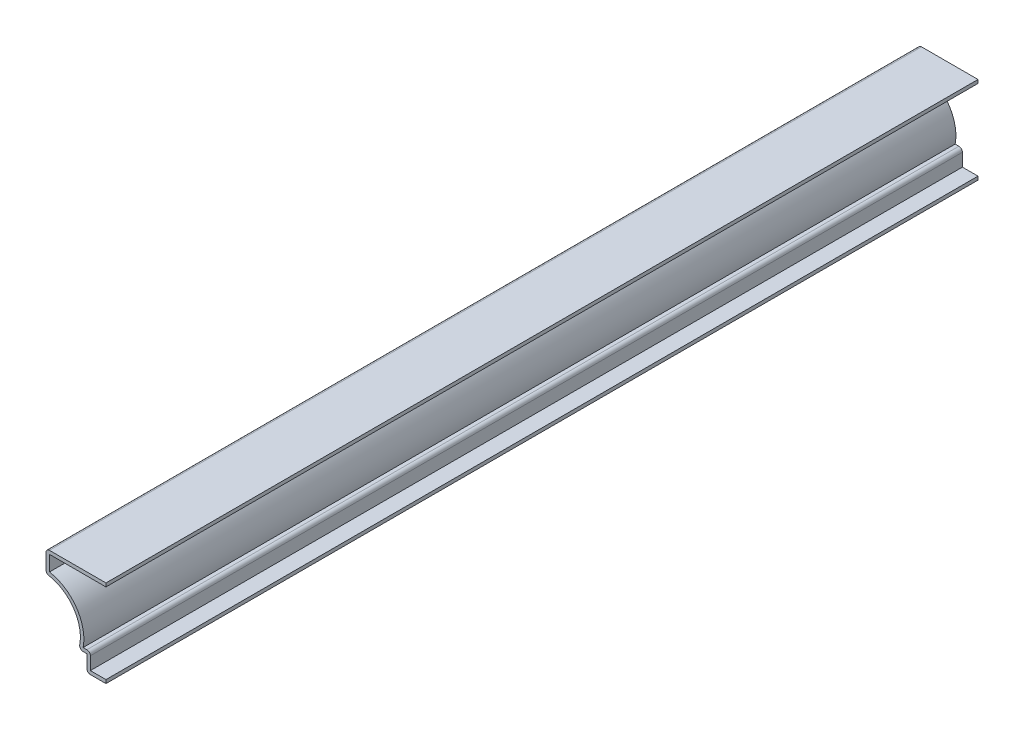
ISO-10303-21;
HEADER;
FILE_DESCRIPTION(('STEP AP214'),'2;1');
FILE_NAME('part.step','',(''),(''),'','','');
FILE_SCHEMA(('AUTOMOTIVE_DESIGN { 1 0 10303 214 1 1 1 1 }'));
ENDSEC;
DATA;
#1=APPLICATION_CONTEXT('core data for automotive mechanical design processes');
#2=APPLICATION_PROTOCOL_DEFINITION('international standard','automotive_design',2000,#1);
#3=PRODUCT_CONTEXT('',#1,'mechanical');
#4=PRODUCT('Part','Part','',(#3));
#5=PRODUCT_RELATED_PRODUCT_CATEGORY('part','',(#4));
#6=PRODUCT_DEFINITION_FORMATION('','',#4);
#7=PRODUCT_DEFINITION_CONTEXT('part definition',#1,'design');
#8=PRODUCT_DEFINITION('design','',#6,#7);
#9=PRODUCT_DEFINITION_SHAPE('','',#8);
#10=(LENGTH_UNIT() NAMED_UNIT(*) SI_UNIT(.MILLI.,.METRE.));
#11=(NAMED_UNIT(*) PLANE_ANGLE_UNIT() SI_UNIT($,.RADIAN.));
#12=(NAMED_UNIT(*) SI_UNIT($,.STERADIAN.) SOLID_ANGLE_UNIT());
#13=UNCERTAINTY_MEASURE_WITH_UNIT(LENGTH_MEASURE(1.E-05),#10,'distance_accuracy_value','');
#14=(GEOMETRIC_REPRESENTATION_CONTEXT(3) GLOBAL_UNCERTAINTY_ASSIGNED_CONTEXT((#13)) GLOBAL_UNIT_ASSIGNED_CONTEXT((#10,
#11,#12)) REPRESENTATION_CONTEXT('',''));
#15=CARTESIAN_POINT('',(0.,0.,0.));
#16=DIRECTION('',(0.,0.,1.));
#17=DIRECTION('',(1.,0.,0.));
#18=AXIS2_PLACEMENT_3D('',#15,#16,#17);
#19=CARTESIAN_POINT('',(-17.4625,24.384,-254.));
#20=DIRECTION('',(0.,-1.,0.));
#21=DIRECTION('',(1.,0.,0.));
#22=AXIS2_PLACEMENT_3D('',#19,#20,#21);
#23=PLANE('',#22);
#24=DIRECTION('',(1.,0.,0.));
#25=VECTOR('',#24,1.);
#26=CARTESIAN_POINT('',(-17.4625,24.384,0.));
#27=LINE('',#26,#25);
#28=CARTESIAN_POINT('',(-16.4465,24.384,0.));
#29=VERTEX_POINT('',#28);
#30=CARTESIAN_POINT('',(0.,24.384,0.));
#31=VERTEX_POINT('',#30);
#32=EDGE_CURVE('E225',#29,#31,#27,.T.);
#33=ORIENTED_EDGE('',*,*,#32,.F.);
#34=DIRECTION('',(0.,0.,1.));
#35=VECTOR('',#34,1.);
#36=CARTESIAN_POINT('',(-16.4465,24.384,-254.));
#37=LINE('',#36,#35);
#38=CARTESIAN_POINT('',(-16.4465,24.384,-254.));
#39=VERTEX_POINT('',#38);
#40=EDGE_CURVE('E191',#39,#29,#37,.T.);
#41=ORIENTED_EDGE('',*,*,#40,.F.);
#42=DIRECTION('',(1.,0.,0.));
#43=VECTOR('',#42,1.);
#44=CARTESIAN_POINT('',(-17.4625,24.384,-254.));
#45=LINE('',#44,#43);
#46=CARTESIAN_POINT('',(0.,24.384,-254.));
#47=VERTEX_POINT('',#46);
#48=EDGE_CURVE('E173',#39,#47,#45,.T.);
#49=ORIENTED_EDGE('',*,*,#48,.T.);
#50=DIRECTION('',(0.,0.,1.));
#51=VECTOR('',#50,1.);
#52=CARTESIAN_POINT('',(0.,24.384,-254.));
#53=LINE('',#52,#51);
#54=EDGE_CURVE('E181',#47,#31,#53,.T.);
#55=ORIENTED_EDGE('',*,*,#54,.T.);
#56=EDGE_LOOP('',(#33,#41,#49,#55));
#57=FACE_BOUND('',#56,.T.);
#58=ADVANCED_FACE('F35',(#57),#23,.T.);
#59=CARTESIAN_POINT('',(-16.4465,19.05,-254.));
#60=DIRECTION('',(1.,0.,0.));
#61=DIRECTION('',(0.,0.,-1.));
#62=AXIS2_PLACEMENT_3D('',#59,#60,#61);
#63=PLANE('',#62);
#64=DIRECTION('',(0.,1.,0.));
#65=VECTOR('',#64,1.);
#66=CARTESIAN_POINT('',(-16.4465,19.05,0.));
#67=LINE('',#66,#65);
#68=CARTESIAN_POINT('',(-16.4465,19.9339748960366,0.));
#69=VERTEX_POINT('',#68);
#70=EDGE_CURVE('E192',#69,#29,#67,.T.);
#71=ORIENTED_EDGE('',*,*,#70,.F.);
#72=DIRECTION('',(0.,0.,1.));
#73=VECTOR('',#72,1.);
#74=CARTESIAN_POINT('',(-16.4465,19.9339748960366,-254.));
#75=LINE('',#74,#73);
#76=CARTESIAN_POINT('',(-16.4465,19.9339748960366,-254.));
#77=VERTEX_POINT('',#76);
#78=EDGE_CURVE('E257',#77,#69,#75,.T.);
#79=ORIENTED_EDGE('',*,*,#78,.F.);
#80=DIRECTION('',(0.,1.,0.));
#81=VECTOR('',#80,1.);
#82=CARTESIAN_POINT('',(-16.4465,19.05,-254.));
#83=LINE('',#82,#81);
#84=EDGE_CURVE('E189',#77,#39,#83,.T.);
#85=ORIENTED_EDGE('',*,*,#84,.T.);
#86=ORIENTED_EDGE('',*,*,#40,.T.);
#87=EDGE_LOOP('',(#71,#79,#85,#86));
#88=FACE_BOUND('',#87,.T.);
#89=ADVANCED_FACE('F326',(#88),#63,.T.);
#90=CARTESIAN_POINT('',(-18.5701184199659,7.99283772002272,-254.));
#91=DIRECTION('',(0.,0.,1.));
#92=DIRECTION('',(1.,0.,0.));
#93=AXIS2_PLACEMENT_3D('',#90,#91,#92);
#94=CYLINDRICAL_SURFACE('',#93,12.1285);
#95=CARTESIAN_POINT('',(-18.5701184199659,7.99283772002272,0.));
#96=DIRECTION('',(0.,0.,1.));
#97=DIRECTION('',(1.,0.,0.));
#98=AXIS2_PLACEMENT_3D('',#95,#96,#97);
#99=CIRCLE('',#98,12.1285);
#100=CARTESIAN_POINT('',(-6.6454708062339,5.7785,0.));
#101=VERTEX_POINT('',#100);
#102=EDGE_CURVE('E195',#101,#69,#99,.T.);
#103=ORIENTED_EDGE('',*,*,#102,.F.);
#104=DIRECTION('',(0.,0.,1.));
#105=VECTOR('',#104,1.);
#106=CARTESIAN_POINT('',(-6.6454708062339,5.7785,-254.));
#107=LINE('',#106,#105);
#108=CARTESIAN_POINT('',(-6.6454708062339,5.7785,-254.));
#109=VERTEX_POINT('',#108);
#110=EDGE_CURVE('E259',#109,#101,#107,.T.);
#111=ORIENTED_EDGE('',*,*,#110,.F.);
#112=CARTESIAN_POINT('',(-18.5701184199659,7.99283772002272,-254.));
#113=DIRECTION('',(0.,0.,1.));
#114=DIRECTION('',(1.,0.,0.));
#115=AXIS2_PLACEMENT_3D('',#112,#113,#114);
#116=CIRCLE('',#115,12.1285);
#117=EDGE_CURVE('E221',#109,#77,#116,.T.);
#118=ORIENTED_EDGE('',*,*,#117,.T.);
#119=ORIENTED_EDGE('',*,*,#78,.T.);
#120=EDGE_LOOP('',(#103,#111,#118,#119));
#121=FACE_BOUND('',#120,.T.);
#122=ADVANCED_FACE('F332',(#121),#94,.T.);
#123=CARTESIAN_POINT('',(-5.55625,5.7785,-254.));
#124=DIRECTION('',(0.,1.,0.));
#125=DIRECTION('',(-1.,0.,0.));
#126=AXIS2_PLACEMENT_3D('',#123,#124,#125);
#127=PLANE('',#126);
#128=DIRECTION('',(-1.,0.,0.));
#129=VECTOR('',#128,1.);
#130=CARTESIAN_POINT('',(-5.55625,5.7785,0.));
#131=LINE('',#130,#129);
#132=CARTESIAN_POINT('',(-5.55625,5.7785,0.));
#133=VERTEX_POINT('',#132);
#134=EDGE_CURVE('E251',#133,#101,#131,.T.);
#135=ORIENTED_EDGE('',*,*,#134,.F.);
#136=DIRECTION('',(0.,0.,1.));
#137=VECTOR('',#136,1.);
#138=CARTESIAN_POINT('',(-5.55625,5.7785,-254.));
#139=LINE('',#138,#137);
#140=CARTESIAN_POINT('',(-5.55625,5.7785,-254.));
#141=VERTEX_POINT('',#140);
#142=EDGE_CURVE('E299',#133,#141,#139,.F.);
#143=ORIENTED_EDGE('',*,*,#142,.T.);
#144=DIRECTION('',(-1.,0.,0.));
#145=VECTOR('',#144,1.);
#146=CARTESIAN_POINT('',(-5.55625,5.7785,-254.));
#147=LINE('',#146,#145);
#148=EDGE_CURVE('E219',#141,#109,#147,.T.);
#149=ORIENTED_EDGE('',*,*,#148,.T.);
#150=ORIENTED_EDGE('',*,*,#110,.T.);
#151=EDGE_LOOP('',(#135,#143,#149,#150));
#152=FACE_BOUND('',#151,.T.);
#153=ADVANCED_FACE('F335',(#152),#127,.T.);
#154=CARTESIAN_POINT('',(-4.54025,0.,-254.));
#155=DIRECTION('',(1.,0.,0.));
#156=DIRECTION('',(0.,0.,-1.));
#157=AXIS2_PLACEMENT_3D('',#154,#155,#156);
#158=PLANE('',#157);
#159=DIRECTION('',(0.,1.,0.));
#160=VECTOR('',#159,1.);
#161=CARTESIAN_POINT('',(-4.54025,0.,-254.));
#162=LINE('',#161,#160);
#163=CARTESIAN_POINT('',(-4.54025,1.016,-254.));
#164=VERTEX_POINT('',#163);
#165=CARTESIAN_POINT('',(-4.54025,4.7625,-254.));
#166=VERTEX_POINT('',#165);
#167=EDGE_CURVE('E216',#164,#166,#162,.T.);
#168=ORIENTED_EDGE('',*,*,#167,.T.);
#169=DIRECTION('',(0.,0.,1.));
#170=VECTOR('',#169,1.);
#171=CARTESIAN_POINT('',(-4.54025,4.7625,-254.));
#172=LINE('',#171,#170);
#173=CARTESIAN_POINT('',(-4.54025,4.7625,0.));
#174=VERTEX_POINT('',#173);
#175=EDGE_CURVE('E296',#166,#174,#172,.T.);
#176=ORIENTED_EDGE('',*,*,#175,.T.);
#177=DIRECTION('',(0.,1.,0.));
#178=VECTOR('',#177,1.);
#179=CARTESIAN_POINT('',(-4.54025,0.,0.));
#180=LINE('',#179,#178);
#181=CARTESIAN_POINT('',(-4.54025,1.016,0.));
#182=VERTEX_POINT('',#181);
#183=EDGE_CURVE('E248',#182,#174,#180,.T.);
#184=ORIENTED_EDGE('',*,*,#183,.F.);
#185=DIRECTION('',(0.,0.,1.));
#186=VECTOR('',#185,1.);
#187=CARTESIAN_POINT('',(-4.54025,1.016,-254.));
#188=LINE('',#187,#186);
#189=EDGE_CURVE('E262',#164,#182,#188,.T.);
#190=ORIENTED_EDGE('',*,*,#189,.F.);
#191=EDGE_LOOP('',(#168,#176,#184,#190));
#192=FACE_BOUND('',#191,.T.);
#193=ADVANCED_FACE('F343',(#192),#158,.T.);
#194=CARTESIAN_POINT('',(0.,1.016,-254.));
#195=DIRECTION('',(0.,1.,0.));
#196=DIRECTION('',(0.,0.,1.));
#197=AXIS2_PLACEMENT_3D('',#194,#195,#196);
#198=PLANE('',#197);
#199=DIRECTION('',(1.,0.,0.));
#200=VECTOR('',#199,1.);
#201=CARTESIAN_POINT('',(0.,1.016,0.));
#202=LINE('',#201,#200);
#203=CARTESIAN_POINT('',(0.,1.016,0.));
#204=VERTEX_POINT('',#203);
#205=EDGE_CURVE('E245',#204,#182,#202,.F.);
#206=ORIENTED_EDGE('',*,*,#205,.F.);
#207=DIRECTION('',(0.,0.,1.));
#208=VECTOR('',#207,1.);
#209=CARTESIAN_POINT('',(0.,1.016,-254.));
#210=LINE('',#209,#208);
#211=CARTESIAN_POINT('',(0.,1.016,-254.));
#212=VERTEX_POINT('',#211);
#213=EDGE_CURVE('E264',#212,#204,#210,.T.);
#214=ORIENTED_EDGE('',*,*,#213,.F.);
#215=DIRECTION('',(1.,0.,0.));
#216=VECTOR('',#215,1.);
#217=CARTESIAN_POINT('',(0.,1.016,-254.));
#218=LINE('',#217,#216);
#219=EDGE_CURVE('E213',#212,#164,#218,.F.);
#220=ORIENTED_EDGE('',*,*,#219,.T.);
#221=ORIENTED_EDGE('',*,*,#189,.T.);
#222=EDGE_LOOP('',(#206,#214,#220,#221));
#223=FACE_BOUND('',#222,.T.);
#224=ADVANCED_FACE('F347',(#223),#198,.T.);
#225=CARTESIAN_POINT('',(0.,1.016,-254.));
#226=DIRECTION('',(-1.,0.,0.));
#227=DIRECTION('',(0.,0.,1.));
#228=AXIS2_PLACEMENT_3D('',#225,#226,#227);
#229=PLANE('',#228);
#230=DIRECTION('',(0.,-1.,0.));
#231=VECTOR('',#230,1.);
#232=CARTESIAN_POINT('',(0.,1.016,0.));
#233=LINE('',#232,#231);
#234=CARTESIAN_POINT('',(0.,0.,0.));
#235=VERTEX_POINT('',#234);
#236=EDGE_CURVE('E243',#204,#235,#233,.T.);
#237=ORIENTED_EDGE('',*,*,#236,.T.);
#238=DIRECTION('',(0.,0.,1.));
#239=VECTOR('',#238,1.);
#240=CARTESIAN_POINT('',(0.,0.,-254.));
#241=LINE('',#240,#239);
#242=CARTESIAN_POINT('',(0.,0.,-254.));
#243=VERTEX_POINT('',#242);
#244=EDGE_CURVE('E266',#243,#235,#241,.T.);
#245=ORIENTED_EDGE('',*,*,#244,.F.);
#246=DIRECTION('',(0.,-1.,0.));
#247=VECTOR('',#246,1.);
#248=CARTESIAN_POINT('',(0.,1.016,-254.));
#249=LINE('',#248,#247);
#250=EDGE_CURVE('E211',#212,#243,#249,.T.);
#251=ORIENTED_EDGE('',*,*,#250,.F.);
#252=ORIENTED_EDGE('',*,*,#213,.T.);
#253=EDGE_LOOP('',(#237,#245,#251,#252));
#254=FACE_BOUND('',#253,.T.);
#255=ADVANCED_FACE('F353',(#254),#229,.F.);
#256=CARTESIAN_POINT('',(0.,0.,-254.));
#257=DIRECTION('',(0.,1.,0.));
#258=DIRECTION('',(0.,0.,1.));
#259=AXIS2_PLACEMENT_3D('',#256,#257,#258);
#260=PLANE('',#259);
#261=DIRECTION('',(-1.,0.,0.));
#262=VECTOR('',#261,1.);
#263=CARTESIAN_POINT('',(0.,0.,0.));
#264=LINE('',#263,#262);
#265=CARTESIAN_POINT('',(-4.54025,0.,0.));
#266=VERTEX_POINT('',#265);
#267=EDGE_CURVE('E240',#235,#266,#264,.T.);
#268=ORIENTED_EDGE('',*,*,#267,.T.);
#269=DIRECTION('',(0.,0.,1.));
#270=VECTOR('',#269,1.);
#271=CARTESIAN_POINT('',(-4.54025,0.,-254.));
#272=LINE('',#271,#270);
#273=CARTESIAN_POINT('',(-4.54025,0.,-254.));
#274=VERTEX_POINT('',#273);
#275=EDGE_CURVE('E285',#266,#274,#272,.F.);
#276=ORIENTED_EDGE('',*,*,#275,.T.);
#277=DIRECTION('',(-1.,0.,0.));
#278=VECTOR('',#277,1.);
#279=CARTESIAN_POINT('',(0.,0.,-254.));
#280=LINE('',#279,#278);
#281=EDGE_CURVE('E209',#243,#274,#280,.T.);
#282=ORIENTED_EDGE('',*,*,#281,.F.);
#283=ORIENTED_EDGE('',*,*,#244,.T.);
#284=EDGE_LOOP('',(#268,#276,#282,#283));
#285=FACE_BOUND('',#284,.T.);
#286=ADVANCED_FACE('F357',(#285),#260,.F.);
#287=CARTESIAN_POINT('',(-5.55625,0.,-254.));
#288=DIRECTION('',(1.,0.,0.));
#289=DIRECTION('',(0.,0.,-1.));
#290=AXIS2_PLACEMENT_3D('',#287,#288,#289);
#291=PLANE('',#290);
#292=DIRECTION('',(0.,1.,0.));
#293=VECTOR('',#292,1.);
#294=CARTESIAN_POINT('',(-5.55625,0.,-254.));
#295=LINE('',#294,#293);
#296=CARTESIAN_POINT('',(-5.55625,1.016,-254.));
#297=VERTEX_POINT('',#296);
#298=CARTESIAN_POINT('',(-5.55625,4.7625,-254.));
#299=VERTEX_POINT('',#298);
#300=EDGE_CURVE('E207',#297,#299,#295,.T.);
#301=ORIENTED_EDGE('',*,*,#300,.F.);
#302=DIRECTION('',(0.,0.,1.));
#303=VECTOR('',#302,1.);
#304=CARTESIAN_POINT('',(-5.55625,1.016,-254.));
#305=LINE('',#304,#303);
#306=CARTESIAN_POINT('',(-5.55625,1.016,0.));
#307=VERTEX_POINT('',#306);
#308=EDGE_CURVE('E256',#297,#307,#305,.T.);
#309=ORIENTED_EDGE('',*,*,#308,.T.);
#310=DIRECTION('',(0.,1.,0.));
#311=VECTOR('',#310,1.);
#312=CARTESIAN_POINT('',(-5.55625,0.,0.));
#313=LINE('',#312,#311);
#314=CARTESIAN_POINT('',(-5.55625,4.7625,0.));
#315=VERTEX_POINT('',#314);
#316=EDGE_CURVE('E238',#307,#315,#313,.T.);
#317=ORIENTED_EDGE('',*,*,#316,.T.);
#318=DIRECTION('',(0.,0.,1.));
#319=VECTOR('',#318,1.);
#320=CARTESIAN_POINT('',(-5.55625,4.7625,-254.));
#321=LINE('',#320,#319);
#322=EDGE_CURVE('E269',#299,#315,#321,.T.);
#323=ORIENTED_EDGE('',*,*,#322,.F.);
#324=EDGE_LOOP('',(#301,#309,#317,#323));
#325=FACE_BOUND('',#324,.T.);
#326=ADVANCED_FACE('F365',(#325),#291,.F.);
#327=CARTESIAN_POINT('',(-5.55625,4.7625,-254.));
#328=DIRECTION('',(0.,1.,0.));
#329=DIRECTION('',(-1.,0.,0.));
#330=AXIS2_PLACEMENT_3D('',#327,#328,#329);
#331=PLANE('',#330);
#332=DIRECTION('',(-1.,0.,0.));
#333=VECTOR('',#332,1.);
#334=CARTESIAN_POINT('',(-5.55625,4.7625,0.));
#335=LINE('',#334,#333);
#336=CARTESIAN_POINT('',(-6.6454708062339,4.7625,0.));
#337=VERTEX_POINT('',#336);
#338=EDGE_CURVE('E235',#315,#337,#335,.T.);
#339=ORIENTED_EDGE('',*,*,#338,.T.);
#340=DIRECTION('',(0.,0.,1.));
#341=VECTOR('',#340,1.);
#342=CARTESIAN_POINT('',(-6.6454708062339,4.7625,-254.));
#343=LINE('',#342,#341);
#344=CARTESIAN_POINT('',(-6.6454708062339,4.7625,-254.));
#345=VERTEX_POINT('',#344);
#346=EDGE_CURVE('E306',#337,#345,#343,.F.);
#347=ORIENTED_EDGE('',*,*,#346,.T.);
#348=DIRECTION('',(-1.,0.,0.));
#349=VECTOR('',#348,1.);
#350=CARTESIAN_POINT('',(-5.55625,4.7625,-254.));
#351=LINE('',#350,#349);
#352=EDGE_CURVE('E204',#299,#345,#351,.T.);
#353=ORIENTED_EDGE('',*,*,#352,.F.);
#354=ORIENTED_EDGE('',*,*,#322,.T.);
#355=EDGE_LOOP('',(#339,#347,#353,#354));
#356=FACE_BOUND('',#355,.T.);
#357=ADVANCED_FACE('F369',(#356),#331,.F.);
#358=CARTESIAN_POINT('',(-18.5701184199659,7.99283772002272,-254.));
#359=DIRECTION('',(0.,0.,1.));
#360=DIRECTION('',(1.,0.,0.));
#361=AXIS2_PLACEMENT_3D('',#358,#359,#360);
#362=CYLINDRICAL_SURFACE('',#361,11.1125);
#363=CARTESIAN_POINT('',(-18.5701184199659,7.99283772002272,-254.));
#364=DIRECTION('',(0.,0.,1.));
#365=DIRECTION('',(1.,0.,0.));
#366=AXIS2_PLACEMENT_3D('',#363,#364,#365);
#367=CIRCLE('',#366,11.1125);
#368=CARTESIAN_POINT('',(-7.64439416654653,5.96399425926892,-254.));
#369=VERTEX_POINT('',#368);
#370=CARTESIAN_POINT('',(-16.6243947367511,18.9336702111349,-254.));
#371=VERTEX_POINT('',#370);
#372=EDGE_CURVE('E201',#369,#371,#367,.T.);
#373=ORIENTED_EDGE('',*,*,#372,.F.);
#374=DIRECTION('',(0.,0.,1.));
#375=VECTOR('',#374,1.);
#376=CARTESIAN_POINT('',(-7.64439416654653,5.96399425926892,-254.));
#377=LINE('',#376,#375);
#378=CARTESIAN_POINT('',(-7.64439416654653,5.96399425926892,0.));
#379=VERTEX_POINT('',#378);
#380=EDGE_CURVE('E303',#369,#379,#377,.T.);
#381=ORIENTED_EDGE('',*,*,#380,.T.);
#382=CARTESIAN_POINT('',(-18.5701184199659,7.99283772002272,0.));
#383=DIRECTION('',(0.,0.,1.));
#384=DIRECTION('',(1.,0.,0.));
#385=AXIS2_PLACEMENT_3D('',#382,#383,#384);
#386=CIRCLE('',#385,11.1125);
#387=CARTESIAN_POINT('',(-16.6243947367511,18.9336702111349,0.));
#388=VERTEX_POINT('',#387);
#389=EDGE_CURVE('E232',#379,#388,#386,.T.);
#390=ORIENTED_EDGE('',*,*,#389,.T.);
#391=DIRECTION('',(0.,0.,1.));
#392=VECTOR('',#391,1.);
#393=CARTESIAN_POINT('',(-16.6243947367511,18.9336702111349,-254.));
#394=LINE('',#393,#392);
#395=EDGE_CURVE('E301',#388,#371,#394,.F.);
#396=ORIENTED_EDGE('',*,*,#395,.T.);
#397=EDGE_LOOP('',(#373,#381,#390,#396));
#398=FACE_BOUND('',#397,.T.);
#399=ADVANCED_FACE('F377',(#398),#362,.F.);
#400=CARTESIAN_POINT('',(-17.4625,19.05,-254.));
#401=DIRECTION('',(1.,0.,0.));
#402=DIRECTION('',(0.,0.,-1.));
#403=AXIS2_PLACEMENT_3D('',#400,#401,#402);
#404=PLANE('',#403);
#405=DIRECTION('',(0.,1.,0.));
#406=VECTOR('',#405,1.);
#407=CARTESIAN_POINT('',(-17.4625,19.05,-254.));
#408=LINE('',#407,#406);
#409=CARTESIAN_POINT('',(-17.4625,19.9339748960366,-254.));
#410=VERTEX_POINT('',#409);
#411=CARTESIAN_POINT('',(-17.4625,24.384,-254.));
#412=VERTEX_POINT('',#411);
#413=EDGE_CURVE('E199',#410,#412,#408,.T.);
#414=ORIENTED_EDGE('',*,*,#413,.F.);
#415=DIRECTION('',(0.,0.,1.));
#416=VECTOR('',#415,1.);
#417=CARTESIAN_POINT('',(-17.4625,19.9339748960366,-254.));
#418=LINE('',#417,#416);
#419=CARTESIAN_POINT('',(-17.4625,19.9339748960366,0.));
#420=VERTEX_POINT('',#419);
#421=EDGE_CURVE('E43',#410,#420,#418,.T.);
#422=ORIENTED_EDGE('',*,*,#421,.T.);
#423=DIRECTION('',(0.,1.,0.));
#424=VECTOR('',#423,1.);
#425=CARTESIAN_POINT('',(-17.4625,19.05,0.));
#426=LINE('',#425,#424);
#427=CARTESIAN_POINT('',(-17.4625,24.384,0.));
#428=VERTEX_POINT('',#427);
#429=EDGE_CURVE('E230',#420,#428,#426,.T.);
#430=ORIENTED_EDGE('',*,*,#429,.T.);
#431=DIRECTION('',(0.,0.,1.));
#432=VECTOR('',#431,1.);
#433=CARTESIAN_POINT('',(-17.4625,24.384,-254.));
#434=LINE('',#433,#432);
#435=EDGE_CURVE('E58',#428,#412,#434,.F.);
#436=ORIENTED_EDGE('',*,*,#435,.T.);
#437=EDGE_LOOP('',(#414,#422,#430,#436));
#438=FACE_BOUND('',#437,.T.);
#439=ADVANCED_FACE('F311',(#438),#404,.F.);
#440=CARTESIAN_POINT('',(-17.4625,25.4,-254.));
#441=DIRECTION('',(0.,-1.,0.));
#442=DIRECTION('',(1.,0.,0.));
#443=AXIS2_PLACEMENT_3D('',#440,#441,#442);
#444=PLANE('',#443);
#445=DIRECTION('',(1.,0.,0.));
#446=VECTOR('',#445,1.);
#447=CARTESIAN_POINT('',(-17.4625,25.4,-254.));
#448=LINE('',#447,#446);
#449=CARTESIAN_POINT('',(-16.4465,25.4,-254.));
#450=VERTEX_POINT('',#449);
#451=CARTESIAN_POINT('',(0.,25.4,-254.));
#452=VERTEX_POINT('',#451);
#453=EDGE_CURVE('E175',#450,#452,#448,.T.);
#454=ORIENTED_EDGE('',*,*,#453,.F.);
#455=DIRECTION('',(0.,0.,1.));
#456=VECTOR('',#455,1.);
#457=CARTESIAN_POINT('',(-16.4465,25.4,-254.));
#458=LINE('',#457,#456);
#459=CARTESIAN_POINT('',(-16.4465,25.4,0.));
#460=VERTEX_POINT('',#459);
#461=EDGE_CURVE('E11',#450,#460,#458,.T.);
#462=ORIENTED_EDGE('',*,*,#461,.T.);
#463=DIRECTION('',(1.,0.,0.));
#464=VECTOR('',#463,1.);
#465=CARTESIAN_POINT('',(-17.4625,25.4,0.));
#466=LINE('',#465,#464);
#467=CARTESIAN_POINT('',(0.,25.4,0.));
#468=VERTEX_POINT('',#467);
#469=EDGE_CURVE('E228',#460,#468,#466,.T.);
#470=ORIENTED_EDGE('',*,*,#469,.T.);
#471=DIRECTION('',(0.,0.,1.));
#472=VECTOR('',#471,1.);
#473=CARTESIAN_POINT('',(0.,25.4,-254.));
#474=LINE('',#473,#472);
#475=EDGE_CURVE('E188',#452,#468,#474,.T.);
#476=ORIENTED_EDGE('',*,*,#475,.F.);
#477=EDGE_LOOP('',(#454,#462,#470,#476));
#478=FACE_BOUND('',#477,.T.);
#479=ADVANCED_FACE('F322',(#478),#444,.F.);
#480=CARTESIAN_POINT('',(0.,25.4,-254.));
#481=DIRECTION('',(-1.,0.,0.));
#482=DIRECTION('',(0.,0.,1.));
#483=AXIS2_PLACEMENT_3D('',#480,#481,#482);
#484=PLANE('',#483);
#485=DIRECTION('',(0.,-1.,0.));
#486=VECTOR('',#485,1.);
#487=CARTESIAN_POINT('',(0.,25.4,0.));
#488=LINE('',#487,#486);
#489=EDGE_CURVE('E184',#468,#31,#488,.T.);
#490=ORIENTED_EDGE('',*,*,#489,.T.);
#491=ORIENTED_EDGE('',*,*,#54,.F.);
#492=DIRECTION('',(0.,-1.,0.));
#493=VECTOR('',#492,1.);
#494=CARTESIAN_POINT('',(0.,25.4,-254.));
#495=LINE('',#494,#493);
#496=EDGE_CURVE('E167',#452,#47,#495,.T.);
#497=ORIENTED_EDGE('',*,*,#496,.F.);
#498=ORIENTED_EDGE('',*,*,#475,.T.);
#499=EDGE_LOOP('',(#490,#491,#497,#498));
#500=FACE_BOUND('',#499,.T.);
#501=ADVANCED_FACE('F182',(#500),#484,.F.);
#502=CARTESIAN_POINT('',(-18.5701184199659,7.99283772002272,-254.));
#503=DIRECTION('',(0.,0.,1.));
#504=DIRECTION('',(1.,0.,0.));
#505=AXIS2_PLACEMENT_3D('',#502,#503,#504);
#506=PLANE('',#505);
#507=ORIENTED_EDGE('',*,*,#281,.T.);
#508=CARTESIAN_POINT('',(-4.54025,1.016,-254.));
#509=DIRECTION('',(0.,0.,1.));
#510=DIRECTION('',(1.,0.,0.));
#511=AXIS2_PLACEMENT_3D('',#508,#509,#510);
#512=CIRCLE('',#511,1.016);
#513=EDGE_CURVE('E294',#274,#297,#512,.F.);
#514=ORIENTED_EDGE('',*,*,#513,.T.);
#515=ORIENTED_EDGE('',*,*,#300,.T.);
#516=ORIENTED_EDGE('',*,*,#352,.T.);
#517=CARTESIAN_POINT('',(-6.6454708062339,5.7785,-254.));
#518=DIRECTION('',(0.,0.,1.));
#519=DIRECTION('',(1.,0.,0.));
#520=AXIS2_PLACEMENT_3D('',#517,#518,#519);
#521=CIRCLE('',#520,1.016);
#522=EDGE_CURVE('E290',#345,#369,#521,.F.);
#523=ORIENTED_EDGE('',*,*,#522,.T.);
#524=ORIENTED_EDGE('',*,*,#372,.T.);
#525=CARTESIAN_POINT('',(-16.4465,19.9339748960366,-254.));
#526=DIRECTION('',(0.,0.,1.));
#527=DIRECTION('',(1.,0.,0.));
#528=AXIS2_PLACEMENT_3D('',#525,#526,#527);
#529=CIRCLE('',#528,1.016);
#530=EDGE_CURVE('E288',#371,#410,#529,.F.);
#531=ORIENTED_EDGE('',*,*,#530,.T.);
#532=ORIENTED_EDGE('',*,*,#413,.T.);
#533=CARTESIAN_POINT('',(-16.4465,24.384,-254.));
#534=DIRECTION('',(0.,0.,1.));
#535=DIRECTION('',(1.,0.,0.));
#536=AXIS2_PLACEMENT_3D('',#533,#534,#535);
#537=CIRCLE('',#536,1.016);
#538=EDGE_CURVE('E50',#412,#450,#537,.F.);
#539=ORIENTED_EDGE('',*,*,#538,.T.);
#540=ORIENTED_EDGE('',*,*,#453,.T.);
#541=ORIENTED_EDGE('',*,*,#496,.T.);
#542=ORIENTED_EDGE('',*,*,#48,.F.);
#543=ORIENTED_EDGE('',*,*,#84,.F.);
#544=ORIENTED_EDGE('',*,*,#117,.F.);
#545=ORIENTED_EDGE('',*,*,#148,.F.);
#546=CARTESIAN_POINT('',(-5.55625,4.7625,-254.));
#547=DIRECTION('',(0.,0.,1.));
#548=DIRECTION('',(1.,0.,0.));
#549=AXIS2_PLACEMENT_3D('',#546,#547,#548);
#550=CIRCLE('',#549,1.016);
#551=EDGE_CURVE('E292',#141,#166,#550,.F.);
#552=ORIENTED_EDGE('',*,*,#551,.T.);
#553=ORIENTED_EDGE('',*,*,#167,.F.);
#554=ORIENTED_EDGE('',*,*,#219,.F.);
#555=ORIENTED_EDGE('',*,*,#250,.T.);
#556=EDGE_LOOP('',(#507,#514,#515,#516,#523,#524,#531,#532,#539,#540,#541,#542,#543,#544,#545,
#552,#553,#554,#555));
#557=FACE_BOUND('',#556,.T.);
#558=ADVANCED_FACE('F170',(#557),#506,.F.);
#559=CARTESIAN_POINT('',(-18.5701184199659,7.99283772002272,0.));
#560=DIRECTION('',(0.,0.,1.));
#561=DIRECTION('',(1.,0.,0.));
#562=AXIS2_PLACEMENT_3D('',#559,#560,#561);
#563=PLANE('',#562);
#564=ORIENTED_EDGE('',*,*,#316,.F.);
#565=CARTESIAN_POINT('',(-4.54025,1.016,0.));
#566=DIRECTION('',(0.,0.,1.));
#567=DIRECTION('',(1.,0.,0.));
#568=AXIS2_PLACEMENT_3D('',#565,#566,#567);
#569=CIRCLE('',#568,1.016);
#570=EDGE_CURVE('E283',#307,#266,#569,.T.);
#571=ORIENTED_EDGE('',*,*,#570,.T.);
#572=ORIENTED_EDGE('',*,*,#267,.F.);
#573=ORIENTED_EDGE('',*,*,#236,.F.);
#574=ORIENTED_EDGE('',*,*,#205,.T.);
#575=ORIENTED_EDGE('',*,*,#183,.T.);
#576=CARTESIAN_POINT('',(-5.55625,4.7625,0.));
#577=DIRECTION('',(0.,0.,1.));
#578=DIRECTION('',(1.,0.,0.));
#579=AXIS2_PLACEMENT_3D('',#576,#577,#578);
#580=CIRCLE('',#579,1.016);
#581=EDGE_CURVE('E281',#174,#133,#580,.T.);
#582=ORIENTED_EDGE('',*,*,#581,.T.);
#583=ORIENTED_EDGE('',*,*,#134,.T.);
#584=ORIENTED_EDGE('',*,*,#102,.T.);
#585=ORIENTED_EDGE('',*,*,#70,.T.);
#586=ORIENTED_EDGE('',*,*,#32,.T.);
#587=ORIENTED_EDGE('',*,*,#489,.F.);
#588=ORIENTED_EDGE('',*,*,#469,.F.);
#589=CARTESIAN_POINT('',(-16.4465,24.384,0.));
#590=DIRECTION('',(0.,0.,1.));
#591=DIRECTION('',(1.,0.,0.));
#592=AXIS2_PLACEMENT_3D('',#589,#590,#591);
#593=CIRCLE('',#592,1.016);
#594=EDGE_CURVE('E275',#460,#428,#593,.T.);
#595=ORIENTED_EDGE('',*,*,#594,.T.);
#596=ORIENTED_EDGE('',*,*,#429,.F.);
#597=CARTESIAN_POINT('',(-16.4465,19.9339748960366,0.));
#598=DIRECTION('',(0.,0.,1.));
#599=DIRECTION('',(1.,0.,0.));
#600=AXIS2_PLACEMENT_3D('',#597,#598,#599);
#601=CIRCLE('',#600,1.016);
#602=EDGE_CURVE('E277',#420,#388,#601,.T.);
#603=ORIENTED_EDGE('',*,*,#602,.T.);
#604=ORIENTED_EDGE('',*,*,#389,.F.);
#605=CARTESIAN_POINT('',(-6.6454708062339,5.7785,0.));
#606=DIRECTION('',(0.,0.,1.));
#607=DIRECTION('',(1.,0.,0.));
#608=AXIS2_PLACEMENT_3D('',#605,#606,#607);
#609=CIRCLE('',#608,1.016);
#610=EDGE_CURVE('E279',#379,#337,#609,.T.);
#611=ORIENTED_EDGE('',*,*,#610,.T.);
#612=ORIENTED_EDGE('',*,*,#338,.F.);
#613=EDGE_LOOP('',(#564,#571,#572,#573,#574,#575,#582,#583,#584,#585,#586,#587,#588,#595,#596,
#603,#604,#611,#612));
#614=FACE_BOUND('',#613,.T.);
#615=ADVANCED_FACE('F316',(#614),#563,.T.);
#616=CARTESIAN_POINT('',(-4.54025,1.016,-254.));
#617=DIRECTION('',(0.,0.,1.));
#618=DIRECTION('',(1.,0.,0.));
#619=AXIS2_PLACEMENT_3D('',#616,#617,#618);
#620=CYLINDRICAL_SURFACE('',#619,1.016);
#621=ORIENTED_EDGE('',*,*,#513,.F.);
#622=ORIENTED_EDGE('',*,*,#275,.F.);
#623=ORIENTED_EDGE('',*,*,#570,.F.);
#624=ORIENTED_EDGE('',*,*,#308,.F.);
#625=EDGE_LOOP('',(#621,#622,#623,#624));
#626=FACE_BOUND('',#625,.T.);
#627=ADVANCED_FACE('F360',(#626),#620,.T.);
#628=CARTESIAN_POINT('',(-5.55625,4.7625,-254.));
#629=DIRECTION('',(0.,0.,1.));
#630=DIRECTION('',(1.,0.,0.));
#631=AXIS2_PLACEMENT_3D('',#628,#629,#630);
#632=CYLINDRICAL_SURFACE('',#631,1.016);
#633=ORIENTED_EDGE('',*,*,#551,.F.);
#634=ORIENTED_EDGE('',*,*,#142,.F.);
#635=ORIENTED_EDGE('',*,*,#581,.F.);
#636=ORIENTED_EDGE('',*,*,#175,.F.);
#637=EDGE_LOOP('',(#633,#634,#635,#636));
#638=FACE_BOUND('',#637,.T.);
#639=ADVANCED_FACE('F338',(#638),#632,.T.);
#640=CARTESIAN_POINT('',(-6.6454708062339,5.7785,-254.));
#641=DIRECTION('',(0.,0.,1.));
#642=DIRECTION('',(1.,0.,0.));
#643=AXIS2_PLACEMENT_3D('',#640,#641,#642);
#644=CYLINDRICAL_SURFACE('',#643,1.016);
#645=ORIENTED_EDGE('',*,*,#522,.F.);
#646=ORIENTED_EDGE('',*,*,#346,.F.);
#647=ORIENTED_EDGE('',*,*,#610,.F.);
#648=ORIENTED_EDGE('',*,*,#380,.F.);
#649=EDGE_LOOP('',(#645,#646,#647,#648));
#650=FACE_BOUND('',#649,.T.);
#651=ADVANCED_FACE('F375',(#650),#644,.T.);
#652=CARTESIAN_POINT('',(-16.4465,19.9339748960366,-254.));
#653=DIRECTION('',(0.,0.,1.));
#654=DIRECTION('',(1.,0.,0.));
#655=AXIS2_PLACEMENT_3D('',#652,#653,#654);
#656=CYLINDRICAL_SURFACE('',#655,1.016);
#657=ORIENTED_EDGE('',*,*,#530,.F.);
#658=ORIENTED_EDGE('',*,*,#395,.F.);
#659=ORIENTED_EDGE('',*,*,#602,.F.);
#660=ORIENTED_EDGE('',*,*,#421,.F.);
#661=EDGE_LOOP('',(#657,#658,#659,#660));
#662=FACE_BOUND('',#661,.T.);
#663=ADVANCED_FACE('F379',(#662),#656,.T.);
#664=CARTESIAN_POINT('',(-16.4465,24.384,-254.));
#665=DIRECTION('',(0.,0.,1.));
#666=DIRECTION('',(1.,0.,0.));
#667=AXIS2_PLACEMENT_3D('',#664,#665,#666);
#668=CYLINDRICAL_SURFACE('',#667,1.016);
#669=ORIENTED_EDGE('',*,*,#538,.F.);
#670=ORIENTED_EDGE('',*,*,#435,.F.);
#671=ORIENTED_EDGE('',*,*,#594,.F.);
#672=ORIENTED_EDGE('',*,*,#461,.F.);
#673=EDGE_LOOP('',(#669,#670,#671,#672));
#674=FACE_BOUND('',#673,.T.);
#675=ADVANCED_FACE('F37',(#674),#668,.T.);
#676=CLOSED_SHELL('',(#58,#89,#122,#153,#193,#224,#255,#286,#326,#357,#399,#439,#479,#501,#558,
#615,#627,#639,#651,#663,#675));
#677=MANIFOLD_SOLID_BREP('B2',#676);
#678=ADVANCED_BREP_SHAPE_REPRESENTATION('',(#18,#677),#14);
#679=SHAPE_DEFINITION_REPRESENTATION(#9,#678);
ENDSEC;
END-ISO-10303-21;
